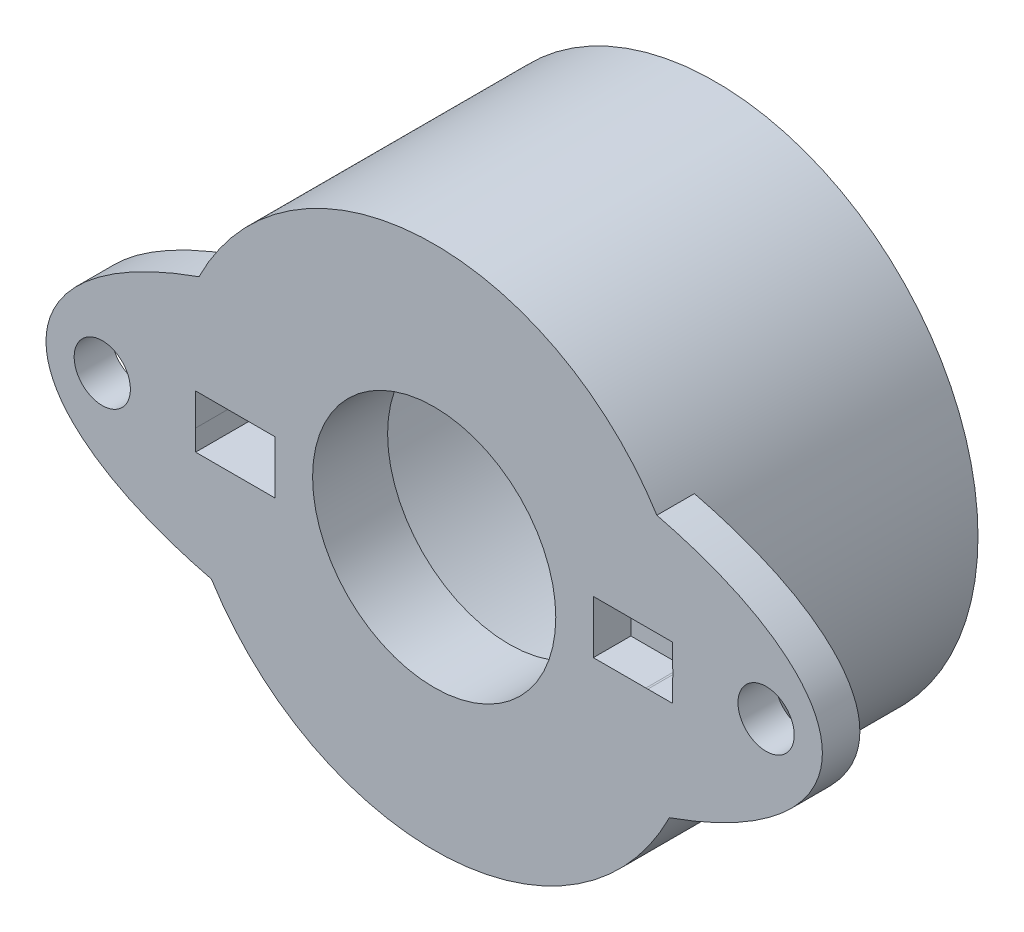
ISO-10303-21;
HEADER;
FILE_DESCRIPTION(('STEP AP214'),'2;1');
FILE_NAME('part.step','',(''),(''),'','','');
FILE_SCHEMA(('AUTOMOTIVE_DESIGN { 1 0 10303 214 1 1 1 1 }'));
ENDSEC;
DATA;
#1=APPLICATION_CONTEXT('core data for automotive mechanical design processes');
#2=APPLICATION_PROTOCOL_DEFINITION('international standard','automotive_design',2000,#1);
#3=PRODUCT_CONTEXT('',#1,'mechanical');
#4=PRODUCT('Part','Part','',(#3));
#5=PRODUCT_RELATED_PRODUCT_CATEGORY('part','',(#4));
#6=PRODUCT_DEFINITION_FORMATION('','',#4);
#7=PRODUCT_DEFINITION_CONTEXT('part definition',#1,'design');
#8=PRODUCT_DEFINITION('design','',#6,#7);
#9=PRODUCT_DEFINITION_SHAPE('','',#8);
#10=(LENGTH_UNIT() NAMED_UNIT(*) SI_UNIT(.MILLI.,.METRE.));
#11=(NAMED_UNIT(*) PLANE_ANGLE_UNIT() SI_UNIT($,.RADIAN.));
#12=(NAMED_UNIT(*) SI_UNIT($,.STERADIAN.) SOLID_ANGLE_UNIT());
#13=UNCERTAINTY_MEASURE_WITH_UNIT(LENGTH_MEASURE(1.E-05),#10,'distance_accuracy_value','');
#14=(GEOMETRIC_REPRESENTATION_CONTEXT(3) GLOBAL_UNCERTAINTY_ASSIGNED_CONTEXT((#13)) GLOBAL_UNIT_ASSIGNED_CONTEXT((#10,
#11,#12)) REPRESENTATION_CONTEXT('',''));
#15=CARTESIAN_POINT('',(0.,0.,0.));
#16=DIRECTION('',(0.,0.,1.));
#17=DIRECTION('',(1.,0.,0.));
#18=AXIS2_PLACEMENT_3D('',#15,#16,#17);
#19=CARTESIAN_POINT('',(0.,0.,13.));
#20=DIRECTION('',(0.,0.,-1.));
#21=DIRECTION('',(-1.,0.,0.));
#22=AXIS2_PLACEMENT_3D('',#19,#20,#21);
#23=CYLINDRICAL_SURFACE('',#22,12.75);
#24=DIRECTION('',(0.,0.,-1.));
#25=VECTOR('',#24,1.);
#26=CARTESIAN_POINT('',(-12.7211773427825,-0.856823793715949,13.));
#27=LINE('',#26,#25);
#28=CARTESIAN_POINT('',(-12.7211773427825,-0.856823793715996,13.));
#29=VERTEX_POINT('',#28);
#30=CARTESIAN_POINT('',(-12.7211773427825,-0.856823793715949,15.));
#31=VERTEX_POINT('',#30);
#32=EDGE_CURVE('E237',#29,#31,#27,.F.);
#33=ORIENTED_EDGE('',*,*,#32,.F.);
#34=CARTESIAN_POINT('',(0.,0.,13.));
#35=DIRECTION('',(0.,0.,-1.));
#36=DIRECTION('',(-1.,0.,0.));
#37=AXIS2_PLACEMENT_3D('',#34,#35,#36);
#38=CIRCLE('',#37,12.75);
#39=CARTESIAN_POINT('',(-12.7211893337537,-0.856645746380808,13.));
#40=VERTEX_POINT('',#39);
#41=EDGE_CURVE('E258',#29,#40,#38,.T.);
#42=ORIENTED_EDGE('',*,*,#41,.T.);
#43=DIRECTION('',(0.,0.,-1.));
#44=VECTOR('',#43,1.);
#45=CARTESIAN_POINT('',(-12.7211893337537,-0.856645746380761,23.));
#46=LINE('',#45,#44);
#47=CARTESIAN_POINT('',(-12.7211893337537,-0.856645746380761,15.));
#48=VERTEX_POINT('',#47);
#49=EDGE_CURVE('E271',#48,#40,#46,.T.);
#50=ORIENTED_EDGE('',*,*,#49,.F.);
#51=CARTESIAN_POINT('',(0.,0.,15.));
#52=DIRECTION('',(0.,0.,1.));
#53=DIRECTION('',(1.,0.,0.));
#54=AXIS2_PLACEMENT_3D('',#51,#52,#53);
#55=CIRCLE('',#54,12.75);
#56=EDGE_CURVE('E353',#48,#31,#55,.T.);
#57=ORIENTED_EDGE('',*,*,#56,.T.);
#58=EDGE_LOOP('',(#33,#42,#50,#57));
#59=FACE_BOUND('',#58,.T.);
#60=ADVANCED_FACE('F45',(#59),#23,.F.);
#61=CARTESIAN_POINT('',(0.,0.,15.));
#62=DIRECTION('',(0.,0.,1.));
#63=DIRECTION('',(1.,0.,0.));
#64=AXIS2_PLACEMENT_3D('',#61,#62,#63);
#65=PLANE('',#64);
#66=CARTESIAN_POINT('',(0.,0.,15.));
#67=DIRECTION('',(0.,0.,1.));
#68=DIRECTION('',(1.,0.,0.));
#69=AXIS2_PLACEMENT_3D('',#66,#67,#68);
#70=CIRCLE('',#69,6.48453934032966);
#71=CARTESIAN_POINT('',(6.48453934032966,0.,15.));
#72=VERTEX_POINT('',#71);
#73=EDGE_CURVE('E251',#72,#72,#70,.T.);
#74=ORIENTED_EDGE('',*,*,#73,.F.);
#75=EDGE_LOOP('',(#74));
#76=FACE_BOUND('',#75,.T.);
#77=DIRECTION('',(1.,0.,0.));
#78=VECTOR('',#77,1.);
#79=CARTESIAN_POINT('',(0.,-0.856645746380762,15.));
#80=LINE('',#79,#78);
#81=CARTESIAN_POINT('',(8.48784282791254,-0.856645746380762,15.));
#82=VERTEX_POINT('',#81);
#83=CARTESIAN_POINT('',(11.2903360021171,-0.856645746380762,15.));
#84=VERTEX_POINT('',#83);
#85=EDGE_CURVE('E329',#82,#84,#80,.T.);
#86=ORIENTED_EDGE('',*,*,#85,.F.);
#87=DIRECTION('',(0.,-1.,0.));
#88=VECTOR('',#87,1.);
#89=CARTESIAN_POINT('',(8.48784282791254,0.,15.));
#90=LINE('',#89,#88);
#91=CARTESIAN_POINT('',(8.48784282791254,1.97192308123216,15.));
#92=VERTEX_POINT('',#91);
#93=EDGE_CURVE('E330',#92,#82,#90,.T.);
#94=ORIENTED_EDGE('',*,*,#93,.F.);
#95=DIRECTION('',(1.,0.,0.));
#96=VECTOR('',#95,1.);
#97=CARTESIAN_POINT('',(0.,1.97192308123216,15.));
#98=LINE('',#97,#96);
#99=CARTESIAN_POINT('',(12.7211893337537,1.97192308123216,15.));
#100=VERTEX_POINT('',#99);
#101=EDGE_CURVE('E333',#92,#100,#98,.T.);
#102=ORIENTED_EDGE('',*,*,#101,.T.);
#103=DIRECTION('',(0.,-1.,0.));
#104=VECTOR('',#103,1.);
#105=CARTESIAN_POINT('',(12.7211893337537,0.,15.));
#106=LINE('',#105,#104);
#107=CARTESIAN_POINT('',(12.7211893337537,0.749710807936883,15.));
#108=VERTEX_POINT('',#107);
#109=EDGE_CURVE('E325',#100,#108,#106,.T.);
#110=ORIENTED_EDGE('',*,*,#109,.T.);
#111=CARTESIAN_POINT('',(11.3408356439444,0.53881264755256,15.));
#112=DIRECTION('',(0.,0.,1.));
#113=DIRECTION('',(1.,0.,0.));
#114=AXIS2_PLACEMENT_3D('',#111,#112,#113);
#115=CIRCLE('',#114,1.39637184983931);
#116=CARTESIAN_POINT('',(12.7211893337537,0.327914487168236,15.));
#117=VERTEX_POINT('',#116);
#118=EDGE_CURVE('E362',#117,#108,#115,.T.);
#119=ORIENTED_EDGE('',*,*,#118,.F.);
#120=CARTESIAN_POINT('',(12.7211893337537,-0.856645746380762,15.));
#121=VERTEX_POINT('',#120);
#122=EDGE_CURVE('E275',#117,#121,#106,.T.);
#123=ORIENTED_EDGE('',*,*,#122,.T.);
#124=CARTESIAN_POINT('',(11.3913352857716,-0.856645746380762,15.));
#125=VERTEX_POINT('',#124);
#126=EDGE_CURVE('E326',#125,#121,#80,.T.);
#127=ORIENTED_EDGE('',*,*,#126,.F.);
#128=EDGE_CURVE('E372',#84,#125,#115,.T.);
#129=ORIENTED_EDGE('',*,*,#128,.F.);
#130=EDGE_LOOP('',(#86,#94,#102,#110,#119,#123,#127,#129));
#131=FACE_BOUND('',#130,.T.);
#132=CARTESIAN_POINT('',(17.7000848217665,0.922540908908955,15.));
#133=DIRECTION('',(0.,0.,1.));
#134=DIRECTION('',(1.,0.,0.));
#135=AXIS2_PLACEMENT_3D('',#132,#133,#134);
#136=CIRCLE('',#135,1.5);
#137=CARTESIAN_POINT('',(19.2000848217665,0.922540908908955,15.));
#138=VERTEX_POINT('',#137);
#139=EDGE_CURVE('E376',#138,#138,#136,.T.);
#140=ORIENTED_EDGE('',*,*,#139,.F.);
#141=EDGE_LOOP('',(#140));
#142=FACE_BOUND('',#141,.T.);
#143=CARTESIAN_POINT('',(-17.7000848217665,-0.808134051441495,15.));
#144=DIRECTION('',(0.,0.,1.));
#145=DIRECTION('',(1.,0.,0.));
#146=AXIS2_PLACEMENT_3D('',#143,#144,#145);
#147=CIRCLE('',#146,1.5);
#148=CARTESIAN_POINT('',(-16.2000848217665,-0.808134051441495,15.));
#149=VERTEX_POINT('',#148);
#150=EDGE_CURVE('E367',#149,#149,#147,.T.);
#151=ORIENTED_EDGE('',*,*,#150,.F.);
#152=EDGE_LOOP('',(#151));
#153=FACE_BOUND('',#152,.T.);
#154=CARTESIAN_POINT('',(0.,0.,15.));
#155=DIRECTION('',(0.,0.,1.));
#156=DIRECTION('',(1.,0.,0.));
#157=AXIS2_PLACEMENT_3D('',#154,#155,#156);
#158=CIRCLE('',#157,14.);
#159=CARTESIAN_POINT('',(11.8761745643199,7.41326363471586,15.));
#160=VERTEX_POINT('',#159);
#161=CARTESIAN_POINT('',(-12.5426629722196,6.21945379959615,15.));
#162=VERTEX_POINT('',#161);
#163=EDGE_CURVE('E425',#160,#162,#158,.T.);
#164=ORIENTED_EDGE('',*,*,#163,.T.);
#165=CARTESIAN_POINT('',(0.,0.,15.));
#166=DIRECTION('',(0.,0.,1.));
#167=DIRECTION('',(-0.998807076272426,-0.0488305681733185,0.));
#168=AXIS2_PLACEMENT_3D('',#165,#166,#167);
#169=ELLIPSE('',#168,20.7212248914212,8.45184408655096);
#170=CARTESIAN_POINT('',(-11.8761745643199,-7.41326363471585,15.));
#171=VERTEX_POINT('',#170);
#172=EDGE_CURVE('E380',#162,#171,#169,.T.);
#173=ORIENTED_EDGE('',*,*,#172,.T.);
#174=CARTESIAN_POINT('',(12.5426629722196,-6.21945379959615,15.));
#175=VERTEX_POINT('',#174);
#176=EDGE_CURVE('E420',#171,#175,#158,.T.);
#177=ORIENTED_EDGE('',*,*,#176,.T.);
#178=EDGE_CURVE('E387',#175,#160,#169,.T.);
#179=ORIENTED_EDGE('',*,*,#178,.T.);
#180=EDGE_LOOP('',(#164,#173,#177,#179));
#181=FACE_BOUND('',#180,.T.);
#182=DIRECTION('',(1.,0.,0.));
#183=VECTOR('',#182,1.);
#184=CARTESIAN_POINT('',(0.,-1.97156702371996,15.));
#185=LINE('',#184,#183);
#186=CARTESIAN_POINT('',(-12.7211773427825,-1.97156702371996,15.));
#187=VERTEX_POINT('',#186);
#188=CARTESIAN_POINT('',(-8.48784282791254,-1.97156702371996,15.));
#189=VERTEX_POINT('',#188);
#190=EDGE_CURVE('E350',#187,#189,#185,.T.);
#191=ORIENTED_EDGE('',*,*,#190,.F.);
#192=DIRECTION('',(0.,1.,0.));
#193=VECTOR('',#192,1.);
#194=CARTESIAN_POINT('',(-12.7211773427825,-1.97156702371996,15.));
#195=LINE('',#194,#193);
#196=EDGE_CURVE('E217',#187,#31,#195,.T.);
#197=ORIENTED_EDGE('',*,*,#196,.T.);
#198=ORIENTED_EDGE('',*,*,#56,.F.);
#199=DIRECTION('',(0.,-1.,0.));
#200=VECTOR('',#199,1.);
#201=CARTESIAN_POINT('',(-12.7211893337537,0.,15.));
#202=LINE('',#201,#200);
#203=CARTESIAN_POINT('',(-12.7211893337537,0.856645746380761,15.));
#204=VERTEX_POINT('',#203);
#205=EDGE_CURVE('E337',#204,#48,#202,.T.);
#206=ORIENTED_EDGE('',*,*,#205,.F.);
#207=CARTESIAN_POINT('',(0.,0.,15.));
#208=DIRECTION('',(0.,0.,1.));
#209=DIRECTION('',(1.,0.,0.));
#210=AXIS2_PLACEMENT_3D('',#207,#208,#209);
#211=CIRCLE('',#210,12.75);
#212=CARTESIAN_POINT('',(-12.7211653518113,0.857001803892965,15.));
#213=VERTEX_POINT('',#212);
#214=EDGE_CURVE('E340',#213,#204,#211,.T.);
#215=ORIENTED_EDGE('',*,*,#214,.F.);
#216=DIRECTION('',(1.,0.,0.));
#217=VECTOR('',#216,1.);
#218=CARTESIAN_POINT('',(0.,0.857001803892965,15.));
#219=LINE('',#218,#217);
#220=CARTESIAN_POINT('',(-8.48784282791254,0.857001803892965,15.));
#221=VERTEX_POINT('',#220);
#222=EDGE_CURVE('E343',#213,#221,#219,.T.);
#223=ORIENTED_EDGE('',*,*,#222,.T.);
#224=DIRECTION('',(0.,-1.,0.));
#225=VECTOR('',#224,1.);
#226=CARTESIAN_POINT('',(-8.48784282791254,0.,15.));
#227=LINE('',#226,#225);
#228=EDGE_CURVE('E347',#221,#189,#227,.T.);
#229=ORIENTED_EDGE('',*,*,#228,.T.);
#230=EDGE_LOOP('',(#191,#197,#198,#206,#215,#223,#229));
#231=FACE_BOUND('',#230,.T.);
#232=ADVANCED_FACE('F402',(#76,#131,#142,#153,#181,#231),#65,.T.);
#233=CARTESIAN_POINT('',(0.,0.,0.));
#234=DIRECTION('',(0.,0.,1.));
#235=DIRECTION('',(1.,0.,0.));
#236=AXIS2_PLACEMENT_3D('',#233,#234,#235);
#237=PLANE('',#236);
#238=CARTESIAN_POINT('',(0.,0.,0.));
#239=DIRECTION('',(0.,0.,1.));
#240=DIRECTION('',(1.,0.,0.));
#241=AXIS2_PLACEMENT_3D('',#238,#239,#240);
#242=CIRCLE('',#241,14.);
#243=CARTESIAN_POINT('',(14.,0.,0.));
#244=VERTEX_POINT('',#243);
#245=EDGE_CURVE('E417',#244,#244,#242,.T.);
#246=ORIENTED_EDGE('',*,*,#245,.F.);
#247=EDGE_LOOP('',(#246));
#248=FACE_BOUND('',#247,.T.);
#249=DIRECTION('',(-1.,0.,0.));
#250=VECTOR('',#249,1.);
#251=CARTESIAN_POINT('',(-8.48784282791254,-1.97156702371996,0.));
#252=LINE('',#251,#250);
#253=CARTESIAN_POINT('',(-12.5966433414216,-1.97156702371996,0.));
#254=VERTEX_POINT('',#253);
#255=CARTESIAN_POINT('',(-12.7211773427825,-1.97156702371996,0.));
#256=VERTEX_POINT('',#255);
#257=EDGE_CURVE('E201',#254,#256,#252,.T.);
#258=ORIENTED_EDGE('',*,*,#257,.F.);
#259=CARTESIAN_POINT('',(0.,0.,0.));
#260=DIRECTION('',(0.,0.,-1.));
#261=DIRECTION('',(-1.,0.,0.));
#262=AXIS2_PLACEMENT_3D('',#259,#260,#261);
#263=CIRCLE('',#262,12.75);
#264=CARTESIAN_POINT('',(-12.7211773427825,-0.856823793715949,0.));
#265=VERTEX_POINT('',#264);
#266=EDGE_CURVE('E222',#265,#254,#263,.T.);
#267=ORIENTED_EDGE('',*,*,#266,.F.);
#268=DIRECTION('',(0.,1.,0.));
#269=VECTOR('',#268,1.);
#270=CARTESIAN_POINT('',(-12.7211773427825,-1.97156702371996,0.));
#271=LINE('',#270,#269);
#272=EDGE_CURVE('E213',#256,#265,#271,.T.);
#273=ORIENTED_EDGE('',*,*,#272,.F.);
#274=EDGE_LOOP('',(#258,#267,#273));
#275=FACE_BOUND('',#274,.T.);
#276=ADVANCED_FACE('F221',(#248,#275),#237,.F.);
#277=DIRECTION('',(0.,0.,-1.));
#278=VECTOR('',#277,1.);
#279=CARTESIAN_POINT('',(-12.7211773427825,-0.856823793715949,13.));
#280=LINE('',#279,#278);
#281=CARTESIAN_POINT('',(-12.7211773427825,-0.856823793715996,11.));
#282=VERTEX_POINT('',#281);
#283=EDGE_CURVE('E67',#265,#282,#280,.F.);
#284=ORIENTED_EDGE('',*,*,#283,.F.);
#285=ORIENTED_EDGE('',*,*,#266,.T.);
#286=DIRECTION('',(0.,0.,-1.));
#287=VECTOR('',#286,1.);
#288=CARTESIAN_POINT('',(-12.5966433414216,-1.97156702371996,13.));
#289=LINE('',#288,#287);
#290=CARTESIAN_POINT('',(-12.5966433414216,-1.97156702371996,11.));
#291=VERTEX_POINT('',#290);
#292=EDGE_CURVE('E208',#291,#254,#289,.T.);
#293=ORIENTED_EDGE('',*,*,#292,.F.);
#294=CARTESIAN_POINT('',(0.,0.,11.));
#295=DIRECTION('',(0.,0.,-1.));
#296=DIRECTION('',(-1.,0.,0.));
#297=AXIS2_PLACEMENT_3D('',#294,#295,#296);
#298=CIRCLE('',#297,12.75);
#299=CARTESIAN_POINT('',(-12.7211773427825,0.856823775136863,11.));
#300=VERTEX_POINT('',#299);
#301=EDGE_CURVE('E247',#300,#291,#298,.T.);
#302=ORIENTED_EDGE('',*,*,#301,.F.);
#303=EDGE_CURVE('E252',#282,#300,#298,.T.);
#304=ORIENTED_EDGE('',*,*,#303,.F.);
#305=EDGE_LOOP('',(#284,#285,#293,#302,#304));
#306=FACE_BOUND('',#305,.T.);
#307=ADVANCED_FACE('F404',(#306),#23,.F.);
#308=CARTESIAN_POINT('',(0.,0.,13.));
#309=DIRECTION('',(0.,0.,-1.));
#310=DIRECTION('',(-1.,0.,0.));
#311=AXIS2_PLACEMENT_3D('',#308,#309,#310);
#312=PLANE('',#311);
#313=DIRECTION('',(0.,-1.,0.));
#314=VECTOR('',#313,1.);
#315=CARTESIAN_POINT('',(-12.7211773427825,0.,13.));
#316=LINE('',#315,#314);
#317=CARTESIAN_POINT('',(-12.7211773427825,0.856823793715996,13.));
#318=VERTEX_POINT('',#317);
#319=EDGE_CURVE('E234',#318,#29,#316,.T.);
#320=ORIENTED_EDGE('',*,*,#319,.F.);
#321=CARTESIAN_POINT('',(-12.7211893337537,0.856645746380761,13.));
#322=VERTEX_POINT('',#321);
#323=EDGE_CURVE('E253',#322,#318,#38,.T.);
#324=ORIENTED_EDGE('',*,*,#323,.F.);
#325=DIRECTION('',(0.,1.,0.));
#326=VECTOR('',#325,1.);
#327=CARTESIAN_POINT('',(-12.7211893337537,0.,13.));
#328=LINE('',#327,#326);
#329=EDGE_CURVE('E259',#40,#322,#328,.T.);
#330=ORIENTED_EDGE('',*,*,#329,.F.);
#331=ORIENTED_EDGE('',*,*,#41,.F.);
#332=EDGE_LOOP('',(#320,#324,#330,#331));
#333=FACE_BOUND('',#332,.T.);
#334=ADVANCED_FACE('F413',(#333),#312,.F.);
#335=CARTESIAN_POINT('',(0.,0.,11.));
#336=DIRECTION('',(0.,0.,-1.));
#337=DIRECTION('',(-1.,0.,0.));
#338=AXIS2_PLACEMENT_3D('',#335,#336,#337);
#339=PLANE('',#338);
#340=CARTESIAN_POINT('',(0.,0.,11.));
#341=DIRECTION('',(0.,0.,-1.));
#342=DIRECTION('',(-1.,0.,0.));
#343=AXIS2_PLACEMENT_3D('',#340,#341,#342);
#344=CIRCLE('',#343,6.48453934032966);
#345=CARTESIAN_POINT('',(-6.48453934032966,0.,11.));
#346=VERTEX_POINT('',#345);
#347=EDGE_CURVE('E246',#346,#346,#344,.T.);
#348=ORIENTED_EDGE('',*,*,#347,.F.);
#349=EDGE_LOOP('',(#348));
#350=FACE_BOUND('',#349,.T.);
#351=ORIENTED_EDGE('',*,*,#301,.T.);
#352=DIRECTION('',(1.,0.,0.));
#353=VECTOR('',#352,1.);
#354=CARTESIAN_POINT('',(0.,-1.97156702371996,11.));
#355=LINE('',#354,#353);
#356=CARTESIAN_POINT('',(-8.48784282791254,-1.97156702371996,11.));
#357=VERTEX_POINT('',#356);
#358=EDGE_CURVE('E11',#291,#357,#355,.T.);
#359=ORIENTED_EDGE('',*,*,#358,.T.);
#360=DIRECTION('',(0.,-1.,0.));
#361=VECTOR('',#360,1.);
#362=CARTESIAN_POINT('',(-8.48784282791254,0.,11.));
#363=LINE('',#362,#361);
#364=CARTESIAN_POINT('',(-8.48784282791254,0.856823775136863,11.));
#365=VERTEX_POINT('',#364);
#366=EDGE_CURVE('E54',#365,#357,#363,.T.);
#367=ORIENTED_EDGE('',*,*,#366,.F.);
#368=DIRECTION('',(1.,0.,0.));
#369=VECTOR('',#368,1.);
#370=CARTESIAN_POINT('',(0.,0.856823775136863,11.));
#371=LINE('',#370,#369);
#372=EDGE_CURVE('E461',#300,#365,#371,.T.);
#373=ORIENTED_EDGE('',*,*,#372,.F.);
#374=EDGE_LOOP('',(#351,#359,#367,#373));
#375=FACE_BOUND('',#374,.T.);
#376=ADVANCED_FACE('F473',(#350,#375),#339,.T.);
#377=ORIENTED_EDGE('',*,*,#303,.T.);
#378=DIRECTION('',(0.,-1.,0.));
#379=VECTOR('',#378,1.);
#380=CARTESIAN_POINT('',(-12.7211773427825,0.,11.));
#381=LINE('',#380,#379);
#382=EDGE_CURVE('E452',#300,#282,#381,.T.);
#383=ORIENTED_EDGE('',*,*,#382,.T.);
#384=EDGE_LOOP('',(#377,#383));
#385=FACE_BOUND('',#384,.T.);
#386=ADVANCED_FACE('F517',(#385),#339,.T.);
#387=ORIENTED_EDGE('',*,*,#214,.T.);
#388=DIRECTION('',(0.,0.,-1.));
#389=VECTOR('',#388,1.);
#390=CARTESIAN_POINT('',(-12.7211893337537,0.856645746380761,23.));
#391=LINE('',#390,#389);
#392=EDGE_CURVE('E284',#204,#322,#391,.T.);
#393=ORIENTED_EDGE('',*,*,#392,.T.);
#394=ORIENTED_EDGE('',*,*,#323,.T.);
#395=CARTESIAN_POINT('',(-12.7211653518113,0.857001803892965,13.));
#396=VERTEX_POINT('',#395);
#397=EDGE_CURVE('E257',#318,#396,#38,.T.);
#398=ORIENTED_EDGE('',*,*,#397,.T.);
#399=DIRECTION('',(0.,0.,-1.));
#400=VECTOR('',#399,1.);
#401=CARTESIAN_POINT('',(-12.7211653518113,0.857001803892965,23.));
#402=LINE('',#401,#400);
#403=EDGE_CURVE('E280',#213,#396,#402,.T.);
#404=ORIENTED_EDGE('',*,*,#403,.F.);
#405=EDGE_LOOP('',(#387,#393,#394,#398,#404));
#406=FACE_BOUND('',#405,.T.);
#407=ADVANCED_FACE('F405',(#406),#23,.F.);
#408=CARTESIAN_POINT('',(11.3408356439444,0.53881264755256,25.));
#409=DIRECTION('',(0.,0.,-1.));
#410=DIRECTION('',(-1.,0.,0.));
#411=AXIS2_PLACEMENT_3D('',#408,#409,#410);
#412=CYLINDRICAL_SURFACE('',#411,1.39637184983931);
#413=DIRECTION('',(0.,0.,-1.));
#414=VECTOR('',#413,1.);
#415=CARTESIAN_POINT('',(12.7211893337537,0.749710807936883,25.));
#416=LINE('',#415,#414);
#417=CARTESIAN_POINT('',(12.7211893337537,0.749710807936883,13.));
#418=VERTEX_POINT('',#417);
#419=EDGE_CURVE('E441',#418,#108,#416,.F.);
#420=ORIENTED_EDGE('',*,*,#419,.F.);
#421=CARTESIAN_POINT('',(11.3408356439444,0.53881264755256,13.));
#422=DIRECTION('',(0.,0.,-1.));
#423=DIRECTION('',(-1.,0.,0.));
#424=AXIS2_PLACEMENT_3D('',#421,#422,#423);
#425=CIRCLE('',#424,1.39637184983931);
#426=CARTESIAN_POINT('',(12.7211893337537,0.327914487168236,13.));
#427=VERTEX_POINT('',#426);
#428=EDGE_CURVE('E358',#418,#427,#425,.T.);
#429=ORIENTED_EDGE('',*,*,#428,.T.);
#430=DIRECTION('',(0.,0.,-1.));
#431=VECTOR('',#430,1.);
#432=CARTESIAN_POINT('',(12.7211893337537,0.327914487168236,25.));
#433=LINE('',#432,#431);
#434=EDGE_CURVE('E437',#117,#427,#433,.T.);
#435=ORIENTED_EDGE('',*,*,#434,.F.);
#436=ORIENTED_EDGE('',*,*,#118,.T.);
#437=EDGE_LOOP('',(#420,#429,#435,#436));
#438=FACE_BOUND('',#437,.T.);
#439=ADVANCED_FACE('F555',(#438),#412,.F.);
#440=CARTESIAN_POINT('',(0.,0.,15.));
#441=DIRECTION('',(0.,0.,-1.));
#442=DIRECTION('',(-1.,0.,0.));
#443=AXIS2_PLACEMENT_3D('',#440,#441,#442);
#444=CYLINDRICAL_SURFACE('',#443,14.);
#445=CARTESIAN_POINT('',(0.,0.,13.));
#446=DIRECTION('',(0.,0.,1.));
#447=DIRECTION('',(1.,0.,0.));
#448=AXIS2_PLACEMENT_3D('',#445,#446,#447);
#449=CIRCLE('',#448,14.);
#450=CARTESIAN_POINT('',(-12.5426629722196,6.21945379959614,13.));
#451=VERTEX_POINT('',#450);
#452=CARTESIAN_POINT('',(-11.8761745643199,-7.41326363471585,13.));
#453=VERTEX_POINT('',#452);
#454=EDGE_CURVE('E433',#451,#453,#449,.T.);
#455=ORIENTED_EDGE('',*,*,#454,.F.);
#456=DIRECTION('',(0.,0.,1.));
#457=VECTOR('',#456,1.);
#458=CARTESIAN_POINT('',(-12.5426629722196,6.21945379959615,13.));
#459=LINE('',#458,#457);
#460=EDGE_CURVE('E427',#451,#162,#459,.T.);
#461=ORIENTED_EDGE('',*,*,#460,.T.);
#462=ORIENTED_EDGE('',*,*,#163,.F.);
#463=DIRECTION('',(0.,0.,1.));
#464=VECTOR('',#463,1.);
#465=CARTESIAN_POINT('',(11.8761745643199,7.41326363471585,13.));
#466=LINE('',#465,#464);
#467=CARTESIAN_POINT('',(11.8761745643199,7.41326363471586,13.));
#468=VERTEX_POINT('',#467);
#469=EDGE_CURVE('E584',#160,#468,#466,.F.);
#470=ORIENTED_EDGE('',*,*,#469,.T.);
#471=CARTESIAN_POINT('',(12.5426629722196,-6.21945379959615,13.));
#472=VERTEX_POINT('',#471);
#473=EDGE_CURVE('E430',#472,#468,#449,.T.);
#474=ORIENTED_EDGE('',*,*,#473,.F.);
#475=DIRECTION('',(0.,0.,1.));
#476=VECTOR('',#475,1.);
#477=CARTESIAN_POINT('',(12.5426629722196,-6.21945379959614,13.));
#478=LINE('',#477,#476);
#479=EDGE_CURVE('E589',#472,#175,#478,.T.);
#480=ORIENTED_EDGE('',*,*,#479,.T.);
#481=ORIENTED_EDGE('',*,*,#176,.F.);
#482=DIRECTION('',(0.,0.,1.));
#483=VECTOR('',#482,1.);
#484=CARTESIAN_POINT('',(-11.8761745643199,-7.41326363471585,13.));
#485=LINE('',#484,#483);
#486=EDGE_CURVE('E577',#171,#453,#485,.F.);
#487=ORIENTED_EDGE('',*,*,#486,.T.);
#488=EDGE_LOOP('',(#455,#461,#462,#470,#474,#480,#481,#487));
#489=FACE_BOUND('',#488,.T.);
#490=ORIENTED_EDGE('',*,*,#245,.T.);
#491=EDGE_LOOP('',(#490));
#492=FACE_BOUND('',#491,.T.);
#493=ADVANCED_FACE('F47',(#489,#492),#444,.T.);
#494=CARTESIAN_POINT('',(0.,0.,13.));
#495=DIRECTION('',(0.,0.,1.));
#496=DIRECTION('',(1.,0.,0.));
#497=AXIS2_PLACEMENT_3D('',#494,#495,#496);
#498=PLANE('',#497);
#499=CARTESIAN_POINT('',(17.7000848217665,0.922540908908955,13.));
#500=DIRECTION('',(0.,0.,-1.));
#501=DIRECTION('',(-1.,0.,0.));
#502=AXIS2_PLACEMENT_3D('',#499,#500,#501);
#503=CIRCLE('',#502,1.5);
#504=CARTESIAN_POINT('',(16.2000848217665,0.922540908908955,13.));
#505=VERTEX_POINT('',#504);
#506=EDGE_CURVE('E363',#505,#505,#503,.T.);
#507=ORIENTED_EDGE('',*,*,#506,.F.);
#508=EDGE_LOOP('',(#507));
#509=FACE_BOUND('',#508,.T.);
#510=CARTESIAN_POINT('',(0.,0.,13.));
#511=DIRECTION('',(0.,0.,1.));
#512=DIRECTION('',(-0.998807076272426,-0.0488305681733185,0.));
#513=AXIS2_PLACEMENT_3D('',#510,#511,#512);
#514=ELLIPSE('',#513,20.7212248914212,8.45184408655096);
#515=EDGE_CURVE('E386',#472,#468,#514,.T.);
#516=ORIENTED_EDGE('',*,*,#515,.F.);
#517=ORIENTED_EDGE('',*,*,#473,.T.);
#518=EDGE_LOOP('',(#516,#517));
#519=FACE_BOUND('',#518,.T.);
#520=ADVANCED_FACE('F398',(#509,#519),#498,.F.);
#521=DIRECTION('',(0.,0.,1.));
#522=VECTOR('',#521,1.);
#523=SURFACE_OF_LINEAR_EXTRUSION('',#514,#522);
#524=ORIENTED_EDGE('',*,*,#479,.F.);
#525=ORIENTED_EDGE('',*,*,#515,.T.);
#526=ORIENTED_EDGE('',*,*,#469,.F.);
#527=ORIENTED_EDGE('',*,*,#178,.F.);
#528=EDGE_LOOP('',(#524,#525,#526,#527));
#529=FACE_BOUND('',#528,.T.);
#530=ADVANCED_FACE('F397',(#529),#523,.T.);
#531=CARTESIAN_POINT('',(-17.7000848217665,-0.808134051441495,13.));
#532=DIRECTION('',(0.,0.,-1.));
#533=DIRECTION('',(-1.,0.,0.));
#534=AXIS2_PLACEMENT_3D('',#531,#532,#533);
#535=CIRCLE('',#534,1.5);
#536=CARTESIAN_POINT('',(-19.2000848217665,-0.808134051441495,13.));
#537=VERTEX_POINT('',#536);
#538=EDGE_CURVE('E368',#537,#537,#535,.T.);
#539=ORIENTED_EDGE('',*,*,#538,.F.);
#540=EDGE_LOOP('',(#539));
#541=FACE_BOUND('',#540,.T.);
#542=EDGE_CURVE('E381',#451,#453,#514,.T.);
#543=ORIENTED_EDGE('',*,*,#542,.F.);
#544=ORIENTED_EDGE('',*,*,#454,.T.);
#545=EDGE_LOOP('',(#543,#544));
#546=FACE_BOUND('',#545,.T.);
#547=ADVANCED_FACE('F395',(#541,#546),#498,.F.);
#548=ORIENTED_EDGE('',*,*,#460,.F.);
#549=ORIENTED_EDGE('',*,*,#542,.T.);
#550=ORIENTED_EDGE('',*,*,#486,.F.);
#551=ORIENTED_EDGE('',*,*,#172,.F.);
#552=EDGE_LOOP('',(#548,#549,#550,#551));
#553=FACE_BOUND('',#552,.T.);
#554=ADVANCED_FACE('F390',(#553),#523,.T.);
#555=CARTESIAN_POINT('',(-17.7000848217665,-0.808134051441495,25.));
#556=DIRECTION('',(0.,0.,-1.));
#557=DIRECTION('',(-1.,0.,0.));
#558=AXIS2_PLACEMENT_3D('',#555,#556,#557);
#559=CYLINDRICAL_SURFACE('',#558,1.5);
#560=ORIENTED_EDGE('',*,*,#150,.T.);
#561=EDGE_LOOP('',(#560));
#562=FACE_BOUND('',#561,.T.);
#563=ORIENTED_EDGE('',*,*,#538,.T.);
#564=EDGE_LOOP('',(#563));
#565=FACE_BOUND('',#564,.T.);
#566=ADVANCED_FACE('F394',(#562,#565),#559,.F.);
#567=CARTESIAN_POINT('',(17.7000848217665,0.922540908908955,25.));
#568=DIRECTION('',(0.,0.,-1.));
#569=DIRECTION('',(-1.,0.,0.));
#570=AXIS2_PLACEMENT_3D('',#567,#568,#569);
#571=CYLINDRICAL_SURFACE('',#570,1.5);
#572=ORIENTED_EDGE('',*,*,#139,.T.);
#573=EDGE_LOOP('',(#572));
#574=FACE_BOUND('',#573,.T.);
#575=ORIENTED_EDGE('',*,*,#506,.T.);
#576=EDGE_LOOP('',(#575));
#577=FACE_BOUND('',#576,.T.);
#578=ADVANCED_FACE('F553',(#574,#577),#571,.F.);
#579=CARTESIAN_POINT('',(11.3913352857716,-0.856645746380762,13.));
#580=VERTEX_POINT('',#579);
#581=CARTESIAN_POINT('',(11.2903360021171,-0.856645746380762,13.));
#582=VERTEX_POINT('',#581);
#583=EDGE_CURVE('E357',#580,#582,#425,.T.);
#584=ORIENTED_EDGE('',*,*,#583,.T.);
#585=DIRECTION('',(0.,0.,-1.));
#586=VECTOR('',#585,1.);
#587=CARTESIAN_POINT('',(11.2903360021171,-0.856645746380762,25.));
#588=LINE('',#587,#586);
#589=EDGE_CURVE('E448',#582,#84,#588,.F.);
#590=ORIENTED_EDGE('',*,*,#589,.T.);
#591=ORIENTED_EDGE('',*,*,#128,.T.);
#592=DIRECTION('',(0.,0.,-1.));
#593=VECTOR('',#592,1.);
#594=CARTESIAN_POINT('',(11.3913352857716,-0.856645746380762,25.));
#595=LINE('',#594,#593);
#596=EDGE_CURVE('E444',#125,#580,#595,.T.);
#597=ORIENTED_EDGE('',*,*,#596,.T.);
#598=EDGE_LOOP('',(#584,#590,#591,#597));
#599=FACE_BOUND('',#598,.T.);
#600=ADVANCED_FACE('F545',(#599),#412,.F.);
#601=CARTESIAN_POINT('',(12.7211893337537,-0.856645746380762,23.));
#602=DIRECTION('',(-1.,0.,0.));
#603=DIRECTION('',(0.,0.,1.));
#604=AXIS2_PLACEMENT_3D('',#601,#602,#603);
#605=PLANE('',#604);
#606=ORIENTED_EDGE('',*,*,#434,.T.);
#607=DIRECTION('',(0.,1.,0.));
#608=VECTOR('',#607,1.);
#609=CARTESIAN_POINT('',(12.7211893337537,-0.856645746380762,13.));
#610=LINE('',#609,#608);
#611=CARTESIAN_POINT('',(12.7211893337537,-0.856645746380762,13.));
#612=VERTEX_POINT('',#611);
#613=EDGE_CURVE('E308',#612,#427,#610,.T.);
#614=ORIENTED_EDGE('',*,*,#613,.F.);
#615=DIRECTION('',(0.,0.,-1.));
#616=VECTOR('',#615,1.);
#617=CARTESIAN_POINT('',(12.7211893337537,-0.856645746380762,23.));
#618=LINE('',#617,#616);
#619=EDGE_CURVE('E299',#121,#612,#618,.T.);
#620=ORIENTED_EDGE('',*,*,#619,.F.);
#621=ORIENTED_EDGE('',*,*,#122,.F.);
#622=EDGE_LOOP('',(#606,#614,#620,#621));
#623=FACE_BOUND('',#622,.T.);
#624=ADVANCED_FACE('F542',(#623),#605,.T.);
#625=CARTESIAN_POINT('',(12.7211893337537,-0.856645746380762,23.));
#626=DIRECTION('',(0.,-1.,0.));
#627=DIRECTION('',(0.,0.,-1.));
#628=AXIS2_PLACEMENT_3D('',#625,#626,#627);
#629=PLANE('',#628);
#630=ORIENTED_EDGE('',*,*,#126,.T.);
#631=ORIENTED_EDGE('',*,*,#619,.T.);
#632=DIRECTION('',(-1.,0.,0.));
#633=VECTOR('',#632,1.);
#634=CARTESIAN_POINT('',(12.7211893337537,-0.856645746380762,13.));
#635=LINE('',#634,#633);
#636=EDGE_CURVE('E312',#612,#580,#635,.T.);
#637=ORIENTED_EDGE('',*,*,#636,.T.);
#638=ORIENTED_EDGE('',*,*,#596,.F.);
#639=EDGE_LOOP('',(#630,#631,#637,#638));
#640=FACE_BOUND('',#639,.T.);
#641=ADVANCED_FACE('F538',(#640),#629,.F.);
#642=ORIENTED_EDGE('',*,*,#85,.T.);
#643=ORIENTED_EDGE('',*,*,#589,.F.);
#644=CARTESIAN_POINT('',(8.48784282791254,-0.856645746380762,13.));
#645=VERTEX_POINT('',#644);
#646=EDGE_CURVE('E311',#582,#645,#635,.T.);
#647=ORIENTED_EDGE('',*,*,#646,.T.);
#648=DIRECTION('',(0.,0.,-1.));
#649=VECTOR('',#648,1.);
#650=CARTESIAN_POINT('',(8.48784282791254,-0.856645746380762,23.));
#651=LINE('',#650,#649);
#652=EDGE_CURVE('E295',#82,#645,#651,.T.);
#653=ORIENTED_EDGE('',*,*,#652,.F.);
#654=EDGE_LOOP('',(#642,#643,#647,#653));
#655=FACE_BOUND('',#654,.T.);
#656=ADVANCED_FACE('F541',(#655),#629,.F.);
#657=DIRECTION('',(0.,0.,-1.));
#658=VECTOR('',#657,1.);
#659=CARTESIAN_POINT('',(12.7211893337537,1.97192308123216,23.));
#660=LINE('',#659,#658);
#661=CARTESIAN_POINT('',(12.7211893337537,1.97192308123216,13.));
#662=VERTEX_POINT('',#661);
#663=EDGE_CURVE('E303',#100,#662,#660,.T.);
#664=ORIENTED_EDGE('',*,*,#663,.T.);
#665=EDGE_CURVE('E307',#418,#662,#610,.T.);
#666=ORIENTED_EDGE('',*,*,#665,.F.);
#667=ORIENTED_EDGE('',*,*,#419,.T.);
#668=ORIENTED_EDGE('',*,*,#109,.F.);
#669=EDGE_LOOP('',(#664,#666,#667,#668));
#670=FACE_BOUND('',#669,.T.);
#671=ADVANCED_FACE('F547',(#670),#605,.T.);
#672=ORIENTED_EDGE('',*,*,#665,.T.);
#673=DIRECTION('',(-1.,0.,0.));
#674=VECTOR('',#673,1.);
#675=CARTESIAN_POINT('',(12.7211893337537,1.97192308123216,13.));
#676=LINE('',#675,#674);
#677=CARTESIAN_POINT('',(8.48784282791254,1.97192308123216,13.));
#678=VERTEX_POINT('',#677);
#679=EDGE_CURVE('E264',#662,#678,#676,.T.);
#680=ORIENTED_EDGE('',*,*,#679,.T.);
#681=DIRECTION('',(0.,1.,0.));
#682=VECTOR('',#681,1.);
#683=CARTESIAN_POINT('',(8.48784282791254,-0.856645746380762,13.));
#684=LINE('',#683,#682);
#685=EDGE_CURVE('E316',#645,#678,#684,.T.);
#686=ORIENTED_EDGE('',*,*,#685,.F.);
#687=ORIENTED_EDGE('',*,*,#646,.F.);
#688=ORIENTED_EDGE('',*,*,#583,.F.);
#689=ORIENTED_EDGE('',*,*,#636,.F.);
#690=ORIENTED_EDGE('',*,*,#613,.T.);
#691=ORIENTED_EDGE('',*,*,#428,.F.);
#692=EDGE_LOOP('',(#672,#680,#686,#687,#688,#689,#690,#691));
#693=FACE_BOUND('',#692,.T.);
#694=ADVANCED_FACE('F513',(#693),#312,.F.);
#695=CARTESIAN_POINT('',(12.7211893337537,1.97192308123216,23.));
#696=DIRECTION('',(0.,-1.,0.));
#697=DIRECTION('',(0.,0.,-1.));
#698=AXIS2_PLACEMENT_3D('',#695,#696,#697);
#699=PLANE('',#698);
#700=DIRECTION('',(0.,0.,-1.));
#701=VECTOR('',#700,1.);
#702=CARTESIAN_POINT('',(8.48784282791254,1.97192308123216,23.));
#703=LINE('',#702,#701);
#704=EDGE_CURVE('E291',#92,#678,#703,.T.);
#705=ORIENTED_EDGE('',*,*,#704,.T.);
#706=ORIENTED_EDGE('',*,*,#679,.F.);
#707=ORIENTED_EDGE('',*,*,#663,.F.);
#708=ORIENTED_EDGE('',*,*,#101,.F.);
#709=EDGE_LOOP('',(#705,#706,#707,#708));
#710=FACE_BOUND('',#709,.T.);
#711=ADVANCED_FACE('F531',(#710),#699,.T.);
#712=CARTESIAN_POINT('',(8.48784282791254,-0.856645746380762,23.));
#713=DIRECTION('',(-1.,0.,0.));
#714=DIRECTION('',(0.,0.,1.));
#715=AXIS2_PLACEMENT_3D('',#712,#713,#714);
#716=PLANE('',#715);
#717=ORIENTED_EDGE('',*,*,#93,.T.);
#718=ORIENTED_EDGE('',*,*,#652,.T.);
#719=ORIENTED_EDGE('',*,*,#685,.T.);
#720=ORIENTED_EDGE('',*,*,#704,.F.);
#721=EDGE_LOOP('',(#717,#718,#719,#720));
#722=FACE_BOUND('',#721,.T.);
#723=ADVANCED_FACE('F524',(#722),#716,.F.);
#724=CARTESIAN_POINT('',(0.,-1.97156702371996,23.));
#725=DIRECTION('',(0.,-1.,0.));
#726=DIRECTION('',(0.,0.,-1.));
#727=AXIS2_PLACEMENT_3D('',#724,#725,#726);
#728=PLANE('',#727);
#729=ORIENTED_EDGE('',*,*,#190,.T.);
#730=DIRECTION('',(0.,0.,-1.));
#731=VECTOR('',#730,1.);
#732=CARTESIAN_POINT('',(-8.48784282791254,-1.97156702371996,23.));
#733=LINE('',#732,#731);
#734=EDGE_CURVE('E272',#189,#357,#733,.T.);
#735=ORIENTED_EDGE('',*,*,#734,.T.);
#736=ORIENTED_EDGE('',*,*,#358,.F.);
#737=ORIENTED_EDGE('',*,*,#292,.T.);
#738=ORIENTED_EDGE('',*,*,#257,.T.);
#739=DIRECTION('',(0.,0.,1.));
#740=VECTOR('',#739,1.);
#741=CARTESIAN_POINT('',(-12.7211773427825,-1.97156702371996,0.));
#742=LINE('',#741,#740);
#743=EDGE_CURVE('E205',#256,#187,#742,.T.);
#744=ORIENTED_EDGE('',*,*,#743,.T.);
#745=EDGE_LOOP('',(#729,#735,#736,#737,#738,#744));
#746=FACE_BOUND('',#745,.T.);
#747=ADVANCED_FACE('F204',(#746),#728,.F.);
#748=CARTESIAN_POINT('',(-8.48784282791254,0.,23.));
#749=DIRECTION('',(-1.,0.,0.));
#750=DIRECTION('',(0.,0.,1.));
#751=AXIS2_PLACEMENT_3D('',#748,#749,#750);
#752=PLANE('',#751);
#753=DIRECTION('',(0.,1.,0.));
#754=VECTOR('',#753,1.);
#755=CARTESIAN_POINT('',(-8.48784282791254,0.,13.));
#756=LINE('',#755,#754);
#757=CARTESIAN_POINT('',(-8.48784282791254,0.856823775136863,13.));
#758=VERTEX_POINT('',#757);
#759=CARTESIAN_POINT('',(-8.48784282791254,0.857001803892965,13.));
#760=VERTEX_POINT('',#759);
#761=EDGE_CURVE('E268',#758,#760,#756,.T.);
#762=ORIENTED_EDGE('',*,*,#761,.F.);
#763=DIRECTION('',(0.,0.,1.));
#764=VECTOR('',#763,1.);
#765=CARTESIAN_POINT('',(-8.48784282791254,0.856823775136863,0.));
#766=LINE('',#765,#764);
#767=EDGE_CURVE('E219',#365,#758,#766,.T.);
#768=ORIENTED_EDGE('',*,*,#767,.F.);
#769=ORIENTED_EDGE('',*,*,#366,.T.);
#770=ORIENTED_EDGE('',*,*,#734,.F.);
#771=ORIENTED_EDGE('',*,*,#228,.F.);
#772=DIRECTION('',(0.,0.,-1.));
#773=VECTOR('',#772,1.);
#774=CARTESIAN_POINT('',(-8.48784282791254,0.857001803892965,23.));
#775=LINE('',#774,#773);
#776=EDGE_CURVE('E276',#221,#760,#775,.T.);
#777=ORIENTED_EDGE('',*,*,#776,.T.);
#778=EDGE_LOOP('',(#762,#768,#769,#770,#771,#777));
#779=FACE_BOUND('',#778,.T.);
#780=ADVANCED_FACE('F470',(#779),#752,.T.);
#781=CARTESIAN_POINT('',(0.,0.857001803892965,23.));
#782=DIRECTION('',(0.,-1.,0.));
#783=DIRECTION('',(0.,0.,-1.));
#784=AXIS2_PLACEMENT_3D('',#781,#782,#783);
#785=PLANE('',#784);
#786=ORIENTED_EDGE('',*,*,#403,.T.);
#787=DIRECTION('',(-1.,0.,0.));
#788=VECTOR('',#787,1.);
#789=CARTESIAN_POINT('',(0.,0.857001803892965,13.));
#790=LINE('',#789,#788);
#791=EDGE_CURVE('E263',#760,#396,#790,.T.);
#792=ORIENTED_EDGE('',*,*,#791,.F.);
#793=ORIENTED_EDGE('',*,*,#776,.F.);
#794=ORIENTED_EDGE('',*,*,#222,.F.);
#795=EDGE_LOOP('',(#786,#792,#793,#794));
#796=FACE_BOUND('',#795,.T.);
#797=ADVANCED_FACE('F497',(#796),#785,.T.);
#798=CARTESIAN_POINT('',(-12.7211893337537,0.,23.));
#799=DIRECTION('',(-1.,0.,0.));
#800=DIRECTION('',(0.,0.,1.));
#801=AXIS2_PLACEMENT_3D('',#798,#799,#800);
#802=PLANE('',#801);
#803=ORIENTED_EDGE('',*,*,#205,.T.);
#804=ORIENTED_EDGE('',*,*,#49,.T.);
#805=ORIENTED_EDGE('',*,*,#329,.T.);
#806=ORIENTED_EDGE('',*,*,#392,.F.);
#807=EDGE_LOOP('',(#803,#804,#805,#806));
#808=FACE_BOUND('',#807,.T.);
#809=ADVANCED_FACE('F490',(#808),#802,.F.);
#810=CARTESIAN_POINT('',(0.,0.,23.));
#811=DIRECTION('',(0.,0.,-1.));
#812=DIRECTION('',(-1.,0.,0.));
#813=AXIS2_PLACEMENT_3D('',#810,#811,#812);
#814=CYLINDRICAL_SURFACE('',#813,6.48453934032966);
#815=ORIENTED_EDGE('',*,*,#73,.T.);
#816=EDGE_LOOP('',(#815));
#817=FACE_BOUND('',#816,.T.);
#818=ORIENTED_EDGE('',*,*,#347,.T.);
#819=EDGE_LOOP('',(#818));
#820=FACE_BOUND('',#819,.T.);
#821=ADVANCED_FACE('F511',(#817,#820),#814,.F.);
#822=ORIENTED_EDGE('',*,*,#397,.F.);
#823=DIRECTION('',(1.,0.,0.));
#824=VECTOR('',#823,1.);
#825=CARTESIAN_POINT('',(0.,0.856823775136863,13.));
#826=LINE('',#825,#824);
#827=EDGE_CURVE('E242',#318,#758,#826,.T.);
#828=ORIENTED_EDGE('',*,*,#827,.T.);
#829=ORIENTED_EDGE('',*,*,#761,.T.);
#830=ORIENTED_EDGE('',*,*,#791,.T.);
#831=EDGE_LOOP('',(#822,#828,#829,#830));
#832=FACE_BOUND('',#831,.T.);
#833=ADVANCED_FACE('F501',(#832),#312,.F.);
#834=CARTESIAN_POINT('',(-8.48784282791254,0.856823775136863,0.));
#835=DIRECTION('',(0.,1.,0.));
#836=DIRECTION('',(0.,0.,1.));
#837=AXIS2_PLACEMENT_3D('',#834,#835,#836);
#838=PLANE('',#837);
#839=DIRECTION('',(0.,0.,1.));
#840=VECTOR('',#839,1.);
#841=CARTESIAN_POINT('',(-12.7211773427825,0.856823775136863,0.));
#842=LINE('',#841,#840);
#843=EDGE_CURVE('E61',#300,#318,#842,.T.);
#844=ORIENTED_EDGE('',*,*,#843,.F.);
#845=ORIENTED_EDGE('',*,*,#372,.T.);
#846=ORIENTED_EDGE('',*,*,#767,.T.);
#847=ORIENTED_EDGE('',*,*,#827,.F.);
#848=EDGE_LOOP('',(#844,#845,#846,#847));
#849=FACE_BOUND('',#848,.T.);
#850=ADVANCED_FACE('F503',(#849),#838,.F.);
#851=CARTESIAN_POINT('',(-12.7211773427825,-1.97156702371996,0.));
#852=DIRECTION('',(1.,0.,0.));
#853=DIRECTION('',(0.,0.,-1.));
#854=AXIS2_PLACEMENT_3D('',#851,#852,#853);
#855=PLANE('',#854);
#856=ORIENTED_EDGE('',*,*,#32,.T.);
#857=ORIENTED_EDGE('',*,*,#196,.F.);
#858=ORIENTED_EDGE('',*,*,#743,.F.);
#859=ORIENTED_EDGE('',*,*,#272,.T.);
#860=ORIENTED_EDGE('',*,*,#283,.T.);
#861=ORIENTED_EDGE('',*,*,#382,.F.);
#862=ORIENTED_EDGE('',*,*,#843,.T.);
#863=ORIENTED_EDGE('',*,*,#319,.T.);
#864=EDGE_LOOP('',(#856,#857,#858,#859,#860,#861,#862,#863));
#865=FACE_BOUND('',#864,.T.);
#866=ADVANCED_FACE('F215',(#865),#855,.T.);
#867=CLOSED_SHELL('',(#60,#232,#276,#307,#334,#376,#386,#407,#439,#493,#520,#530,#547,#554,#566,
#578,#600,#624,#641,#656,#671,#694,#711,#723,#747,#780,#797,#809,#821,#833,#850,#866));
#868=MANIFOLD_SOLID_BREP('B2',#867);
#869=ADVANCED_BREP_SHAPE_REPRESENTATION('',(#18,#868),#14);
#870=SHAPE_DEFINITION_REPRESENTATION(#9,#869);
ENDSEC;
END-ISO-10303-21;
